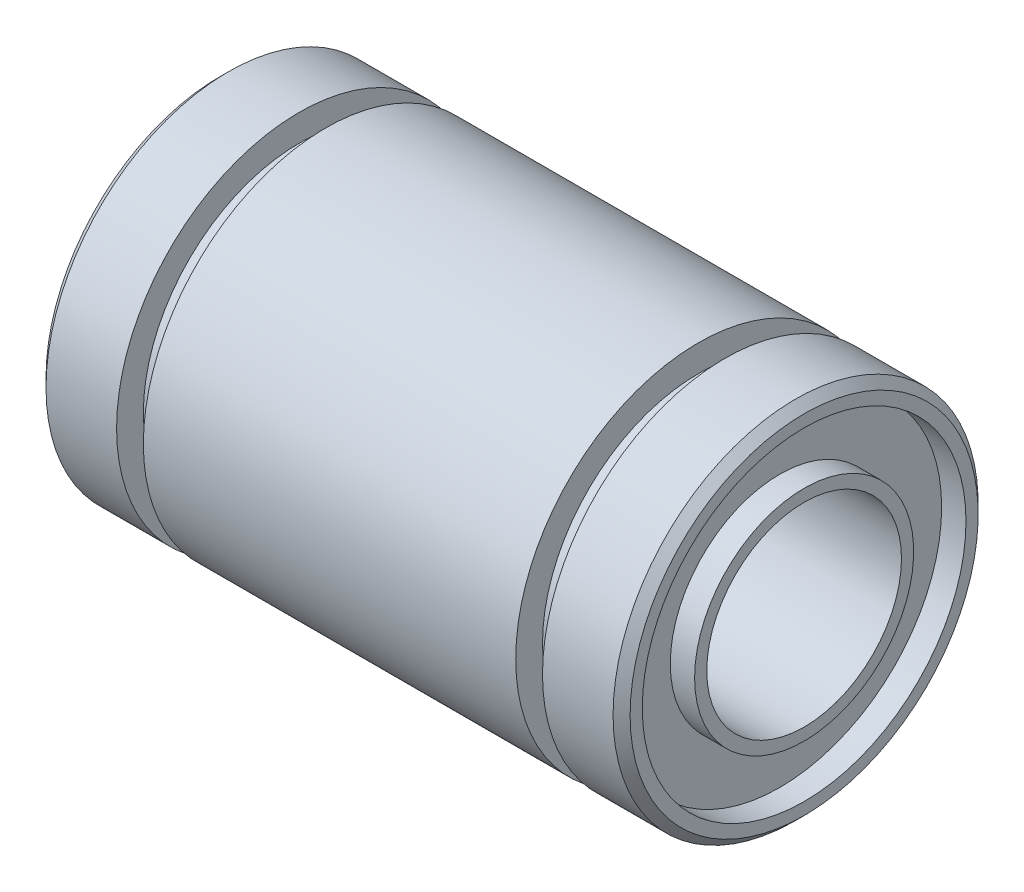
ISO-10303-21;
HEADER;
FILE_DESCRIPTION(('STEP AP214'),'2;1');
FILE_NAME('part.step','',(''),(''),'','','');
FILE_SCHEMA(('AUTOMOTIVE_DESIGN { 1 0 10303 214 1 1 1 1 }'));
ENDSEC;
DATA;
#1=APPLICATION_CONTEXT('core data for automotive mechanical design processes');
#2=APPLICATION_PROTOCOL_DEFINITION('international standard','automotive_design',2000,#1);
#3=PRODUCT_CONTEXT('',#1,'mechanical');
#4=PRODUCT('Part','Part','',(#3));
#5=PRODUCT_RELATED_PRODUCT_CATEGORY('part','',(#4));
#6=PRODUCT_DEFINITION_FORMATION('','',#4);
#7=PRODUCT_DEFINITION_CONTEXT('part definition',#1,'design');
#8=PRODUCT_DEFINITION('design','',#6,#7);
#9=PRODUCT_DEFINITION_SHAPE('','',#8);
#10=(LENGTH_UNIT() NAMED_UNIT(*) SI_UNIT(.MILLI.,.METRE.));
#11=(NAMED_UNIT(*) PLANE_ANGLE_UNIT() SI_UNIT($,.RADIAN.));
#12=(NAMED_UNIT(*) SI_UNIT($,.STERADIAN.) SOLID_ANGLE_UNIT());
#13=UNCERTAINTY_MEASURE_WITH_UNIT(LENGTH_MEASURE(1.E-05),#10,'distance_accuracy_value','');
#14=(GEOMETRIC_REPRESENTATION_CONTEXT(3) GLOBAL_UNCERTAINTY_ASSIGNED_CONTEXT((#13)) GLOBAL_UNIT_ASSIGNED_CONTEXT((#10,
#11,#12)) REPRESENTATION_CONTEXT('',''));
#15=CARTESIAN_POINT('',(0.,0.,0.));
#16=DIRECTION('',(0.,0.,1.));
#17=DIRECTION('',(1.,0.,0.));
#18=AXIS2_PLACEMENT_3D('',#15,#16,#17);
#19=CARTESIAN_POINT('',(11.65,0.,0.));
#20=DIRECTION('',(-1.,0.,0.));
#21=DIRECTION('',(0.,0.,1.));
#22=AXIS2_PLACEMENT_3D('',#19,#20,#21);
#23=CONICAL_SURFACE('',#22,7.5,0.78539816339745);
#24=CARTESIAN_POINT('',(12.,0.,0.));
#25=DIRECTION('',(-1.,0.,0.));
#26=DIRECTION('',(0.,0.,1.));
#27=AXIS2_PLACEMENT_3D('',#24,#25,#26);
#28=CIRCLE('',#27,7.15);
#29=CARTESIAN_POINT('',(12.,0.,7.15));
#30=VERTEX_POINT('',#29);
#31=EDGE_CURVE('E104',#30,#30,#28,.T.);
#32=ORIENTED_EDGE('',*,*,#31,.T.);
#33=EDGE_LOOP('',(#32));
#34=FACE_BOUND('',#33,.T.);
#35=CARTESIAN_POINT('',(11.65,0.,0.));
#36=DIRECTION('',(-1.,0.,0.));
#37=DIRECTION('',(0.,0.,1.));
#38=AXIS2_PLACEMENT_3D('',#35,#36,#37);
#39=CIRCLE('',#38,7.5);
#40=CARTESIAN_POINT('',(11.65,0.,7.5));
#41=VERTEX_POINT('',#40);
#42=EDGE_CURVE('E10',#41,#41,#39,.T.);
#43=ORIENTED_EDGE('',*,*,#42,.F.);
#44=EDGE_LOOP('',(#43));
#45=FACE_BOUND('',#44,.T.);
#46=ADVANCED_FACE('F34',(#34,#45),#23,.T.);
#47=CARTESIAN_POINT('',(-45.6895053247726,0.,0.));
#48=DIRECTION('',(-1.,0.,0.));
#49=DIRECTION('',(0.,0.,1.));
#50=AXIS2_PLACEMENT_3D('',#47,#48,#49);
#51=CYLINDRICAL_SURFACE('',#50,7.5);
#52=CARTESIAN_POINT('',(8.75000000000001,0.,0.));
#53=DIRECTION('',(-1.,0.,0.));
#54=DIRECTION('',(0.,0.,1.));
#55=AXIS2_PLACEMENT_3D('',#52,#53,#54);
#56=CIRCLE('',#55,7.5);
#57=CARTESIAN_POINT('',(8.75000000000001,0.,7.5));
#58=VERTEX_POINT('',#57);
#59=EDGE_CURVE('E40',#58,#58,#56,.T.);
#60=ORIENTED_EDGE('',*,*,#59,.F.);
#61=EDGE_LOOP('',(#60));
#62=FACE_BOUND('',#61,.T.);
#63=ORIENTED_EDGE('',*,*,#42,.T.);
#64=EDGE_LOOP('',(#63));
#65=FACE_BOUND('',#64,.T.);
#66=ADVANCED_FACE('F122',(#62,#65),#51,.T.);
#67=CARTESIAN_POINT('',(8.75000000000001,0.,0.));
#68=DIRECTION('',(1.,0.,0.));
#69=DIRECTION('',(0.,0.,-1.));
#70=AXIS2_PLACEMENT_3D('',#67,#68,#69);
#71=PLANE('',#70);
#72=CARTESIAN_POINT('',(8.75000000000001,0.,0.));
#73=DIRECTION('',(-1.,0.,0.));
#74=DIRECTION('',(0.,0.,1.));
#75=AXIS2_PLACEMENT_3D('',#72,#73,#74);
#76=CIRCLE('',#75,6.4);
#77=CARTESIAN_POINT('',(8.75000000000001,0.,6.4));
#78=VERTEX_POINT('',#77);
#79=EDGE_CURVE('E44',#78,#78,#76,.T.);
#80=ORIENTED_EDGE('',*,*,#79,.F.);
#81=EDGE_LOOP('',(#80));
#82=FACE_BOUND('',#81,.T.);
#83=ORIENTED_EDGE('',*,*,#59,.T.);
#84=EDGE_LOOP('',(#83));
#85=FACE_BOUND('',#84,.T.);
#86=ADVANCED_FACE('F126',(#82,#85),#71,.F.);
#87=CARTESIAN_POINT('',(-45.6895053247726,0.,0.));
#88=DIRECTION('',(-1.,0.,0.));
#89=DIRECTION('',(0.,0.,1.));
#90=AXIS2_PLACEMENT_3D('',#87,#88,#89);
#91=CYLINDRICAL_SURFACE('',#90,6.4);
#92=CARTESIAN_POINT('',(7.65,0.,0.));
#93=DIRECTION('',(-1.,0.,0.));
#94=DIRECTION('',(0.,0.,1.));
#95=AXIS2_PLACEMENT_3D('',#92,#93,#94);
#96=CIRCLE('',#95,6.4);
#97=CARTESIAN_POINT('',(7.65,0.,6.4));
#98=VERTEX_POINT('',#97);
#99=EDGE_CURVE('E48',#98,#98,#96,.T.);
#100=ORIENTED_EDGE('',*,*,#99,.F.);
#101=EDGE_LOOP('',(#100));
#102=FACE_BOUND('',#101,.T.);
#103=ORIENTED_EDGE('',*,*,#79,.T.);
#104=EDGE_LOOP('',(#103));
#105=FACE_BOUND('',#104,.T.);
#106=ADVANCED_FACE('F131',(#102,#105),#91,.T.);
#107=CARTESIAN_POINT('',(7.65,0.,0.));
#108=DIRECTION('',(-1.,0.,0.));
#109=DIRECTION('',(0.,0.,1.));
#110=AXIS2_PLACEMENT_3D('',#107,#108,#109);
#111=PLANE('',#110);
#112=CARTESIAN_POINT('',(7.65,0.,0.));
#113=DIRECTION('',(-1.,0.,0.));
#114=DIRECTION('',(0.,0.,1.));
#115=AXIS2_PLACEMENT_3D('',#112,#113,#114);
#116=CIRCLE('',#115,7.5);
#117=CARTESIAN_POINT('',(7.65,0.,7.5));
#118=VERTEX_POINT('',#117);
#119=EDGE_CURVE('E53',#118,#118,#116,.T.);
#120=ORIENTED_EDGE('',*,*,#119,.F.);
#121=EDGE_LOOP('',(#120));
#122=FACE_BOUND('',#121,.T.);
#123=ORIENTED_EDGE('',*,*,#99,.T.);
#124=EDGE_LOOP('',(#123));
#125=FACE_BOUND('',#124,.T.);
#126=ADVANCED_FACE('F137',(#122,#125),#111,.F.);
#127=CARTESIAN_POINT('',(-45.6895053247726,0.,0.));
#128=DIRECTION('',(-1.,0.,0.));
#129=DIRECTION('',(0.,0.,1.));
#130=AXIS2_PLACEMENT_3D('',#127,#128,#129);
#131=CYLINDRICAL_SURFACE('',#130,7.5);
#132=ORIENTED_EDGE('',*,*,#119,.T.);
#133=EDGE_LOOP('',(#132));
#134=FACE_BOUND('',#133,.T.);
#135=CARTESIAN_POINT('',(-7.65,0.,0.));
#136=DIRECTION('',(-1.,0.,0.));
#137=DIRECTION('',(0.,0.,1.));
#138=AXIS2_PLACEMENT_3D('',#135,#136,#137);
#139=CIRCLE('',#138,7.5);
#140=CARTESIAN_POINT('',(-7.65,0.,7.5));
#141=VERTEX_POINT('',#140);
#142=EDGE_CURVE('E56',#141,#141,#139,.T.);
#143=ORIENTED_EDGE('',*,*,#142,.F.);
#144=EDGE_LOOP('',(#143));
#145=FACE_BOUND('',#144,.T.);
#146=ADVANCED_FACE('F141',(#134,#145),#131,.T.);
#147=CARTESIAN_POINT('',(-7.65,0.,0.));
#148=DIRECTION('',(-1.,0.,0.));
#149=DIRECTION('',(0.,0.,1.));
#150=AXIS2_PLACEMENT_3D('',#147,#148,#149);
#151=PLANE('',#150);
#152=ORIENTED_EDGE('',*,*,#142,.T.);
#153=EDGE_LOOP('',(#152));
#154=FACE_BOUND('',#153,.T.);
#155=CARTESIAN_POINT('',(-7.65,0.,0.));
#156=DIRECTION('',(-1.,0.,0.));
#157=DIRECTION('',(0.,0.,1.));
#158=AXIS2_PLACEMENT_3D('',#155,#156,#157);
#159=CIRCLE('',#158,6.4);
#160=CARTESIAN_POINT('',(-7.65,0.,6.4));
#161=VERTEX_POINT('',#160);
#162=EDGE_CURVE('E59',#161,#161,#159,.T.);
#163=ORIENTED_EDGE('',*,*,#162,.F.);
#164=EDGE_LOOP('',(#163));
#165=FACE_BOUND('',#164,.T.);
#166=ADVANCED_FACE('F145',(#154,#165),#151,.T.);
#167=CARTESIAN_POINT('',(-45.6895053247726,0.,0.));
#168=DIRECTION('',(-1.,0.,0.));
#169=DIRECTION('',(0.,0.,1.));
#170=AXIS2_PLACEMENT_3D('',#167,#168,#169);
#171=CYLINDRICAL_SURFACE('',#170,6.4);
#172=ORIENTED_EDGE('',*,*,#162,.T.);
#173=EDGE_LOOP('',(#172));
#174=FACE_BOUND('',#173,.T.);
#175=CARTESIAN_POINT('',(-8.74999999999999,0.,0.));
#176=DIRECTION('',(-1.,0.,0.));
#177=DIRECTION('',(0.,0.,1.));
#178=AXIS2_PLACEMENT_3D('',#175,#176,#177);
#179=CIRCLE('',#178,6.4);
#180=CARTESIAN_POINT('',(-8.74999999999999,0.,6.4));
#181=VERTEX_POINT('',#180);
#182=EDGE_CURVE('E62',#181,#181,#179,.T.);
#183=ORIENTED_EDGE('',*,*,#182,.F.);
#184=EDGE_LOOP('',(#183));
#185=FACE_BOUND('',#184,.T.);
#186=ADVANCED_FACE('F149',(#174,#185),#171,.T.);
#187=CARTESIAN_POINT('',(-8.75,0.,0.));
#188=DIRECTION('',(1.,0.,0.));
#189=DIRECTION('',(0.,0.,-1.));
#190=AXIS2_PLACEMENT_3D('',#187,#188,#189);
#191=PLANE('',#190);
#192=ORIENTED_EDGE('',*,*,#182,.T.);
#193=EDGE_LOOP('',(#192));
#194=FACE_BOUND('',#193,.T.);
#195=CARTESIAN_POINT('',(-8.74999999999999,0.,0.));
#196=DIRECTION('',(-1.,0.,0.));
#197=DIRECTION('',(0.,0.,1.));
#198=AXIS2_PLACEMENT_3D('',#195,#196,#197);
#199=CIRCLE('',#198,7.5);
#200=CARTESIAN_POINT('',(-8.74999999999999,0.,7.5));
#201=VERTEX_POINT('',#200);
#202=EDGE_CURVE('E65',#201,#201,#199,.T.);
#203=ORIENTED_EDGE('',*,*,#202,.F.);
#204=EDGE_LOOP('',(#203));
#205=FACE_BOUND('',#204,.T.);
#206=ADVANCED_FACE('F153',(#194,#205),#191,.T.);
#207=CARTESIAN_POINT('',(-45.6895053247726,0.,0.));
#208=DIRECTION('',(-1.,0.,0.));
#209=DIRECTION('',(0.,0.,1.));
#210=AXIS2_PLACEMENT_3D('',#207,#208,#209);
#211=CYLINDRICAL_SURFACE('',#210,7.5);
#212=ORIENTED_EDGE('',*,*,#202,.T.);
#213=EDGE_LOOP('',(#212));
#214=FACE_BOUND('',#213,.T.);
#215=CARTESIAN_POINT('',(-11.65,0.,0.));
#216=DIRECTION('',(-1.,0.,0.));
#217=DIRECTION('',(0.,0.,1.));
#218=AXIS2_PLACEMENT_3D('',#215,#216,#217);
#219=CIRCLE('',#218,7.5);
#220=CARTESIAN_POINT('',(-11.65,0.,7.5));
#221=VERTEX_POINT('',#220);
#222=EDGE_CURVE('E68',#221,#221,#219,.T.);
#223=ORIENTED_EDGE('',*,*,#222,.F.);
#224=EDGE_LOOP('',(#223));
#225=FACE_BOUND('',#224,.T.);
#226=ADVANCED_FACE('F157',(#214,#225),#211,.T.);
#227=CARTESIAN_POINT('',(-11.65,0.,0.));
#228=DIRECTION('',(1.,0.,0.));
#229=DIRECTION('',(0.,0.,-1.));
#230=AXIS2_PLACEMENT_3D('',#227,#228,#229);
#231=CONICAL_SURFACE('',#230,7.5,0.78539816339745);
#232=CARTESIAN_POINT('',(-12.,0.,0.));
#233=DIRECTION('',(-1.,0.,0.));
#234=DIRECTION('',(0.,0.,1.));
#235=AXIS2_PLACEMENT_3D('',#232,#233,#234);
#236=CIRCLE('',#235,7.15);
#237=CARTESIAN_POINT('',(-12.,0.,7.15));
#238=VERTEX_POINT('',#237);
#239=EDGE_CURVE('E71',#238,#238,#236,.T.);
#240=ORIENTED_EDGE('',*,*,#239,.F.);
#241=EDGE_LOOP('',(#240));
#242=FACE_BOUND('',#241,.T.);
#243=ORIENTED_EDGE('',*,*,#222,.T.);
#244=EDGE_LOOP('',(#243));
#245=FACE_BOUND('',#244,.T.);
#246=ADVANCED_FACE('F161',(#242,#245),#231,.T.);
#247=CARTESIAN_POINT('',(-12.,0.,0.));
#248=DIRECTION('',(1.,0.,0.));
#249=DIRECTION('',(0.,0.,-1.));
#250=AXIS2_PLACEMENT_3D('',#247,#248,#249);
#251=PLANE('',#250);
#252=CARTESIAN_POINT('',(-12.,0.,0.));
#253=DIRECTION('',(-1.,0.,0.));
#254=DIRECTION('',(0.,0.,1.));
#255=AXIS2_PLACEMENT_3D('',#252,#253,#254);
#256=CIRCLE('',#255,6.65);
#257=CARTESIAN_POINT('',(-12.,0.,6.65));
#258=VERTEX_POINT('',#257);
#259=EDGE_CURVE('E74',#258,#258,#256,.T.);
#260=ORIENTED_EDGE('',*,*,#259,.F.);
#261=EDGE_LOOP('',(#260));
#262=FACE_BOUND('',#261,.T.);
#263=ORIENTED_EDGE('',*,*,#239,.T.);
#264=EDGE_LOOP('',(#263));
#265=FACE_BOUND('',#264,.T.);
#266=ADVANCED_FACE('F165',(#262,#265),#251,.F.);
#267=CARTESIAN_POINT('',(-45.6895053247726,0.,0.));
#268=DIRECTION('',(-1.,0.,0.));
#269=DIRECTION('',(0.,0.,1.));
#270=AXIS2_PLACEMENT_3D('',#267,#268,#269);
#271=CYLINDRICAL_SURFACE('',#270,6.65);
#272=CARTESIAN_POINT('',(-11.,0.,0.));
#273=DIRECTION('',(-1.,0.,0.));
#274=DIRECTION('',(0.,0.,1.));
#275=AXIS2_PLACEMENT_3D('',#272,#273,#274);
#276=CIRCLE('',#275,6.65);
#277=CARTESIAN_POINT('',(-11.,0.,6.65));
#278=VERTEX_POINT('',#277);
#279=EDGE_CURVE('E77',#278,#278,#276,.T.);
#280=ORIENTED_EDGE('',*,*,#279,.F.);
#281=EDGE_LOOP('',(#280));
#282=FACE_BOUND('',#281,.T.);
#283=ORIENTED_EDGE('',*,*,#259,.T.);
#284=EDGE_LOOP('',(#283));
#285=FACE_BOUND('',#284,.T.);
#286=ADVANCED_FACE('F169',(#282,#285),#271,.F.);
#287=CARTESIAN_POINT('',(-11.,0.,0.));
#288=DIRECTION('',(1.,0.,0.));
#289=DIRECTION('',(0.,0.,-1.));
#290=AXIS2_PLACEMENT_3D('',#287,#288,#289);
#291=PLANE('',#290);
#292=CARTESIAN_POINT('',(-11.,0.,0.));
#293=DIRECTION('',(-1.,0.,0.));
#294=DIRECTION('',(0.,0.,1.));
#295=AXIS2_PLACEMENT_3D('',#292,#293,#294);
#296=CIRCLE('',#295,4.5);
#297=CARTESIAN_POINT('',(-11.,0.,4.5));
#298=VERTEX_POINT('',#297);
#299=EDGE_CURVE('E80',#298,#298,#296,.T.);
#300=ORIENTED_EDGE('',*,*,#299,.F.);
#301=EDGE_LOOP('',(#300));
#302=FACE_BOUND('',#301,.T.);
#303=ORIENTED_EDGE('',*,*,#279,.T.);
#304=EDGE_LOOP('',(#303));
#305=FACE_BOUND('',#304,.T.);
#306=ADVANCED_FACE('F173',(#302,#305),#291,.F.);
#307=CARTESIAN_POINT('',(-45.6895053247726,0.,0.));
#308=DIRECTION('',(-1.,0.,0.));
#309=DIRECTION('',(0.,0.,1.));
#310=AXIS2_PLACEMENT_3D('',#307,#308,#309);
#311=CYLINDRICAL_SURFACE('',#310,4.5);
#312=CARTESIAN_POINT('',(-12.,0.,0.));
#313=DIRECTION('',(-1.,0.,0.));
#314=DIRECTION('',(0.,0.,1.));
#315=AXIS2_PLACEMENT_3D('',#312,#313,#314);
#316=CIRCLE('',#315,4.5);
#317=CARTESIAN_POINT('',(-12.,0.,4.5));
#318=VERTEX_POINT('',#317);
#319=EDGE_CURVE('E83',#318,#318,#316,.T.);
#320=ORIENTED_EDGE('',*,*,#319,.F.);
#321=EDGE_LOOP('',(#320));
#322=FACE_BOUND('',#321,.T.);
#323=ORIENTED_EDGE('',*,*,#299,.T.);
#324=EDGE_LOOP('',(#323));
#325=FACE_BOUND('',#324,.T.);
#326=ADVANCED_FACE('F177',(#322,#325),#311,.T.);
#327=CARTESIAN_POINT('',(-12.,0.,0.));
#328=DIRECTION('',(1.,0.,0.));
#329=DIRECTION('',(0.,0.,-1.));
#330=AXIS2_PLACEMENT_3D('',#327,#328,#329);
#331=PLANE('',#330);
#332=CARTESIAN_POINT('',(-12.,0.,0.));
#333=DIRECTION('',(-1.,0.,0.));
#334=DIRECTION('',(0.,0.,1.));
#335=AXIS2_PLACEMENT_3D('',#332,#333,#334);
#336=CIRCLE('',#335,4.);
#337=CARTESIAN_POINT('',(-12.,0.,4.));
#338=VERTEX_POINT('',#337);
#339=EDGE_CURVE('E86',#338,#338,#336,.T.);
#340=ORIENTED_EDGE('',*,*,#339,.F.);
#341=EDGE_LOOP('',(#340));
#342=FACE_BOUND('',#341,.T.);
#343=ORIENTED_EDGE('',*,*,#319,.T.);
#344=EDGE_LOOP('',(#343));
#345=FACE_BOUND('',#344,.T.);
#346=ADVANCED_FACE('F181',(#342,#345),#331,.F.);
#347=CARTESIAN_POINT('',(-45.6895053247726,0.,0.));
#348=DIRECTION('',(-1.,0.,0.));
#349=DIRECTION('',(0.,0.,1.));
#350=AXIS2_PLACEMENT_3D('',#347,#348,#349);
#351=CYLINDRICAL_SURFACE('',#350,4.);
#352=CARTESIAN_POINT('',(12.,0.,0.));
#353=DIRECTION('',(-1.,0.,0.));
#354=DIRECTION('',(0.,0.,1.));
#355=AXIS2_PLACEMENT_3D('',#352,#353,#354);
#356=CIRCLE('',#355,4.);
#357=CARTESIAN_POINT('',(12.,0.,4.));
#358=VERTEX_POINT('',#357);
#359=EDGE_CURVE('E89',#358,#358,#356,.T.);
#360=ORIENTED_EDGE('',*,*,#359,.F.);
#361=EDGE_LOOP('',(#360));
#362=FACE_BOUND('',#361,.T.);
#363=ORIENTED_EDGE('',*,*,#339,.T.);
#364=EDGE_LOOP('',(#363));
#365=FACE_BOUND('',#364,.T.);
#366=ADVANCED_FACE('F185',(#362,#365),#351,.F.);
#367=CARTESIAN_POINT('',(12.,0.,0.));
#368=DIRECTION('',(1.,0.,0.));
#369=DIRECTION('',(0.,0.,-1.));
#370=AXIS2_PLACEMENT_3D('',#367,#368,#369);
#371=PLANE('',#370);
#372=ORIENTED_EDGE('',*,*,#359,.T.);
#373=EDGE_LOOP('',(#372));
#374=FACE_BOUND('',#373,.T.);
#375=CARTESIAN_POINT('',(12.,0.,0.));
#376=DIRECTION('',(-1.,0.,0.));
#377=DIRECTION('',(0.,0.,1.));
#378=AXIS2_PLACEMENT_3D('',#375,#376,#377);
#379=CIRCLE('',#378,4.5);
#380=CARTESIAN_POINT('',(12.,0.,4.5));
#381=VERTEX_POINT('',#380);
#382=EDGE_CURVE('E92',#381,#381,#379,.T.);
#383=ORIENTED_EDGE('',*,*,#382,.F.);
#384=EDGE_LOOP('',(#383));
#385=FACE_BOUND('',#384,.T.);
#386=ADVANCED_FACE('F189',(#374,#385),#371,.T.);
#387=CARTESIAN_POINT('',(-45.6895053247726,0.,0.));
#388=DIRECTION('',(-1.,0.,0.));
#389=DIRECTION('',(0.,0.,1.));
#390=AXIS2_PLACEMENT_3D('',#387,#388,#389);
#391=CYLINDRICAL_SURFACE('',#390,4.5);
#392=ORIENTED_EDGE('',*,*,#382,.T.);
#393=EDGE_LOOP('',(#392));
#394=FACE_BOUND('',#393,.T.);
#395=CARTESIAN_POINT('',(11.,0.,0.));
#396=DIRECTION('',(-1.,0.,0.));
#397=DIRECTION('',(0.,0.,1.));
#398=AXIS2_PLACEMENT_3D('',#395,#396,#397);
#399=CIRCLE('',#398,4.5);
#400=CARTESIAN_POINT('',(11.,0.,4.5));
#401=VERTEX_POINT('',#400);
#402=EDGE_CURVE('E95',#401,#401,#399,.T.);
#403=ORIENTED_EDGE('',*,*,#402,.F.);
#404=EDGE_LOOP('',(#403));
#405=FACE_BOUND('',#404,.T.);
#406=ADVANCED_FACE('F193',(#394,#405),#391,.T.);
#407=CARTESIAN_POINT('',(11.,0.,0.));
#408=DIRECTION('',(1.,0.,0.));
#409=DIRECTION('',(0.,0.,-1.));
#410=AXIS2_PLACEMENT_3D('',#407,#408,#409);
#411=PLANE('',#410);
#412=ORIENTED_EDGE('',*,*,#402,.T.);
#413=EDGE_LOOP('',(#412));
#414=FACE_BOUND('',#413,.T.);
#415=CARTESIAN_POINT('',(11.,0.,0.));
#416=DIRECTION('',(-1.,0.,0.));
#417=DIRECTION('',(0.,0.,1.));
#418=AXIS2_PLACEMENT_3D('',#415,#416,#417);
#419=CIRCLE('',#418,6.65);
#420=CARTESIAN_POINT('',(11.,0.,6.65));
#421=VERTEX_POINT('',#420);
#422=EDGE_CURVE('E98',#421,#421,#419,.T.);
#423=ORIENTED_EDGE('',*,*,#422,.F.);
#424=EDGE_LOOP('',(#423));
#425=FACE_BOUND('',#424,.T.);
#426=ADVANCED_FACE('F118',(#414,#425),#411,.T.);
#427=CARTESIAN_POINT('',(-45.6895053247726,0.,0.));
#428=DIRECTION('',(-1.,0.,0.));
#429=DIRECTION('',(0.,0.,1.));
#430=AXIS2_PLACEMENT_3D('',#427,#428,#429);
#431=CYLINDRICAL_SURFACE('',#430,6.65);
#432=ORIENTED_EDGE('',*,*,#422,.T.);
#433=EDGE_LOOP('',(#432));
#434=FACE_BOUND('',#433,.T.);
#435=CARTESIAN_POINT('',(12.,0.,0.));
#436=DIRECTION('',(-1.,0.,0.));
#437=DIRECTION('',(0.,0.,1.));
#438=AXIS2_PLACEMENT_3D('',#435,#436,#437);
#439=CIRCLE('',#438,6.65);
#440=CARTESIAN_POINT('',(12.,0.,6.65));
#441=VERTEX_POINT('',#440);
#442=EDGE_CURVE('E101',#441,#441,#439,.T.);
#443=ORIENTED_EDGE('',*,*,#442,.F.);
#444=EDGE_LOOP('',(#443));
#445=FACE_BOUND('',#444,.T.);
#446=ADVANCED_FACE('F112',(#434,#445),#431,.F.);
#447=CARTESIAN_POINT('',(12.,0.,0.));
#448=DIRECTION('',(1.,0.,0.));
#449=DIRECTION('',(0.,0.,-1.));
#450=AXIS2_PLACEMENT_3D('',#447,#448,#449);
#451=PLANE('',#450);
#452=ORIENTED_EDGE('',*,*,#442,.T.);
#453=EDGE_LOOP('',(#452));
#454=FACE_BOUND('',#453,.T.);
#455=ORIENTED_EDGE('',*,*,#31,.F.);
#456=EDGE_LOOP('',(#455));
#457=FACE_BOUND('',#456,.T.);
#458=ADVANCED_FACE('F110',(#454,#457),#451,.T.);
#459=CLOSED_SHELL('',(#46,#66,#86,#106,#126,#146,#166,#186,#206,#226,#246,#266,#286,#306,#326,
#346,#366,#386,#406,#426,#446,#458));
#460=MANIFOLD_SOLID_BREP('B2',#459);
#461=ADVANCED_BREP_SHAPE_REPRESENTATION('',(#18,#460),#14);
#462=SHAPE_DEFINITION_REPRESENTATION(#9,#461);
ENDSEC;
END-ISO-10303-21;
